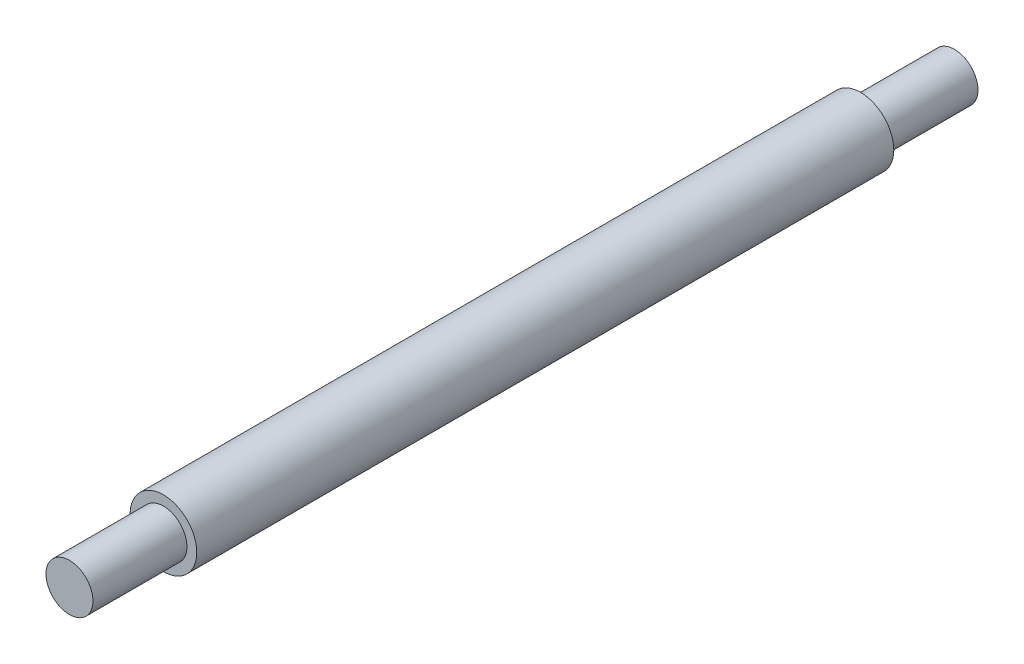
ISO-10303-21;
HEADER;
FILE_DESCRIPTION(('STEP AP214'),'2;1');
FILE_NAME('part.step','',(''),(''),'','','');
FILE_SCHEMA(('AUTOMOTIVE_DESIGN { 1 0 10303 214 1 1 1 1 }'));
ENDSEC;
DATA;
#1=APPLICATION_CONTEXT('core data for automotive mechanical design processes');
#2=APPLICATION_PROTOCOL_DEFINITION('international standard','automotive_design',2000,#1);
#3=PRODUCT_CONTEXT('',#1,'mechanical');
#4=PRODUCT('Part','Part','',(#3));
#5=PRODUCT_RELATED_PRODUCT_CATEGORY('part','',(#4));
#6=PRODUCT_DEFINITION_FORMATION('','',#4);
#7=PRODUCT_DEFINITION_CONTEXT('part definition',#1,'design');
#8=PRODUCT_DEFINITION('design','',#6,#7);
#9=PRODUCT_DEFINITION_SHAPE('','',#8);
#10=(LENGTH_UNIT() NAMED_UNIT(*) SI_UNIT(.MILLI.,.METRE.));
#11=(NAMED_UNIT(*) PLANE_ANGLE_UNIT() SI_UNIT($,.RADIAN.));
#12=(NAMED_UNIT(*) SI_UNIT($,.STERADIAN.) SOLID_ANGLE_UNIT());
#13=UNCERTAINTY_MEASURE_WITH_UNIT(LENGTH_MEASURE(1.E-05),#10,'distance_accuracy_value','');
#14=(GEOMETRIC_REPRESENTATION_CONTEXT(3) GLOBAL_UNCERTAINTY_ASSIGNED_CONTEXT((#13)) GLOBAL_UNIT_ASSIGNED_CONTEXT((#10,
#11,#12)) REPRESENTATION_CONTEXT('',''));
#15=CARTESIAN_POINT('',(0.,0.,0.));
#16=DIRECTION('',(0.,0.,1.));
#17=DIRECTION('',(1.,0.,0.));
#18=AXIS2_PLACEMENT_3D('',#15,#16,#17);
#19=CARTESIAN_POINT('',(0.,0.,0.));
#20=DIRECTION('',(0.,0.,1.));
#21=DIRECTION('',(1.,0.,0.));
#22=AXIS2_PLACEMENT_3D('',#19,#20,#21);
#23=PLANE('',#22);
#24=CARTESIAN_POINT('',(0.,0.,0.));
#25=DIRECTION('',(0.,0.,1.));
#26=DIRECTION('',(1.,0.,0.));
#27=AXIS2_PLACEMENT_3D('',#24,#25,#26);
#28=CIRCLE('',#27,3.);
#29=CARTESIAN_POINT('',(3.,0.,0.));
#30=VERTEX_POINT('',#29);
#31=EDGE_CURVE('E53',#30,#30,#28,.T.);
#32=ORIENTED_EDGE('',*,*,#31,.T.);
#33=EDGE_LOOP('',(#32));
#34=FACE_BOUND('',#33,.T.);
#35=ADVANCED_FACE('F31',(#34),#23,.T.);
#36=CARTESIAN_POINT('',(0.,0.,-113.));
#37=DIRECTION('',(0.,0.,-1.));
#38=DIRECTION('',(-1.,0.,0.));
#39=AXIS2_PLACEMENT_3D('',#36,#37,#38);
#40=PLANE('',#39);
#41=CARTESIAN_POINT('',(0.,0.,-113.));
#42=DIRECTION('',(0.,0.,1.));
#43=DIRECTION('',(1.,0.,0.));
#44=AXIS2_PLACEMENT_3D('',#41,#42,#43);
#45=CIRCLE('',#44,3.);
#46=CARTESIAN_POINT('',(3.,0.,-113.));
#47=VERTEX_POINT('',#46);
#48=EDGE_CURVE('E10',#47,#47,#45,.T.);
#49=ORIENTED_EDGE('',*,*,#48,.F.);
#50=EDGE_LOOP('',(#49));
#51=FACE_BOUND('',#50,.T.);
#52=ADVANCED_FACE('F70',(#51),#40,.T.);
#53=CARTESIAN_POINT('',(0.,0.,0.));
#54=DIRECTION('',(0.,0.,1.));
#55=DIRECTION('',(1.,0.,0.));
#56=AXIS2_PLACEMENT_3D('',#53,#54,#55);
#57=CYLINDRICAL_SURFACE('',#56,3.);
#58=ORIENTED_EDGE('',*,*,#48,.T.);
#59=EDGE_LOOP('',(#58));
#60=FACE_BOUND('',#59,.T.);
#61=CARTESIAN_POINT('',(0.,0.,-101.));
#62=DIRECTION('',(0.,0.,1.));
#63=DIRECTION('',(1.,0.,0.));
#64=AXIS2_PLACEMENT_3D('',#61,#62,#63);
#65=CIRCLE('',#64,3.);
#66=CARTESIAN_POINT('',(3.,0.,-101.));
#67=VERTEX_POINT('',#66);
#68=EDGE_CURVE('E37',#67,#67,#65,.T.);
#69=ORIENTED_EDGE('',*,*,#68,.F.);
#70=EDGE_LOOP('',(#69));
#71=FACE_BOUND('',#70,.T.);
#72=ADVANCED_FACE('F74',(#60,#71),#57,.T.);
#73=CARTESIAN_POINT('',(0.,0.,-101.));
#74=DIRECTION('',(0.,0.,-1.));
#75=DIRECTION('',(-1.,0.,0.));
#76=AXIS2_PLACEMENT_3D('',#73,#74,#75);
#77=PLANE('',#76);
#78=ORIENTED_EDGE('',*,*,#68,.T.);
#79=EDGE_LOOP('',(#78));
#80=FACE_BOUND('',#79,.T.);
#81=CARTESIAN_POINT('',(0.,0.,-101.));
#82=DIRECTION('',(0.,0.,1.));
#83=DIRECTION('',(1.,0.,0.));
#84=AXIS2_PLACEMENT_3D('',#81,#82,#83);
#85=CIRCLE('',#84,4.25);
#86=CARTESIAN_POINT('',(4.25,0.,-101.));
#87=VERTEX_POINT('',#86);
#88=EDGE_CURVE('E41',#87,#87,#85,.T.);
#89=ORIENTED_EDGE('',*,*,#88,.F.);
#90=EDGE_LOOP('',(#89));
#91=FACE_BOUND('',#90,.T.);
#92=ADVANCED_FACE('F79',(#80,#91),#77,.T.);
#93=CARTESIAN_POINT('',(0.,0.,0.));
#94=DIRECTION('',(0.,0.,1.));
#95=DIRECTION('',(1.,0.,0.));
#96=AXIS2_PLACEMENT_3D('',#93,#94,#95);
#97=CYLINDRICAL_SURFACE('',#96,4.25);
#98=ORIENTED_EDGE('',*,*,#88,.T.);
#99=EDGE_LOOP('',(#98));
#100=FACE_BOUND('',#99,.T.);
#101=CARTESIAN_POINT('',(0.,0.,-12.));
#102=DIRECTION('',(0.,0.,1.));
#103=DIRECTION('',(1.,0.,0.));
#104=AXIS2_PLACEMENT_3D('',#101,#102,#103);
#105=CIRCLE('',#104,4.25);
#106=CARTESIAN_POINT('',(4.25,0.,-12.));
#107=VERTEX_POINT('',#106);
#108=EDGE_CURVE('E45',#107,#107,#105,.T.);
#109=ORIENTED_EDGE('',*,*,#108,.F.);
#110=EDGE_LOOP('',(#109));
#111=FACE_BOUND('',#110,.T.);
#112=ADVANCED_FACE('F66',(#100,#111),#97,.T.);
#113=CARTESIAN_POINT('',(0.,0.,-12.));
#114=DIRECTION('',(0.,0.,1.));
#115=DIRECTION('',(1.,0.,0.));
#116=AXIS2_PLACEMENT_3D('',#113,#114,#115);
#117=PLANE('',#116);
#118=ORIENTED_EDGE('',*,*,#108,.T.);
#119=EDGE_LOOP('',(#118));
#120=FACE_BOUND('',#119,.T.);
#121=CARTESIAN_POINT('',(0.,0.,-12.));
#122=DIRECTION('',(0.,0.,1.));
#123=DIRECTION('',(1.,0.,0.));
#124=AXIS2_PLACEMENT_3D('',#121,#122,#123);
#125=CIRCLE('',#124,3.);
#126=CARTESIAN_POINT('',(3.,0.,-12.));
#127=VERTEX_POINT('',#126);
#128=EDGE_CURVE('E50',#127,#127,#125,.T.);
#129=ORIENTED_EDGE('',*,*,#128,.F.);
#130=EDGE_LOOP('',(#129));
#131=FACE_BOUND('',#130,.T.);
#132=ADVANCED_FACE('F60',(#120,#131),#117,.T.);
#133=CARTESIAN_POINT('',(0.,0.,0.));
#134=DIRECTION('',(0.,0.,1.));
#135=DIRECTION('',(1.,0.,0.));
#136=AXIS2_PLACEMENT_3D('',#133,#134,#135);
#137=CYLINDRICAL_SURFACE('',#136,3.);
#138=ORIENTED_EDGE('',*,*,#128,.T.);
#139=EDGE_LOOP('',(#138));
#140=FACE_BOUND('',#139,.T.);
#141=ORIENTED_EDGE('',*,*,#31,.F.);
#142=EDGE_LOOP('',(#141));
#143=FACE_BOUND('',#142,.T.);
#144=ADVANCED_FACE('F58',(#140,#143),#137,.T.);
#145=CLOSED_SHELL('',(#35,#52,#72,#92,#112,#132,#144));
#146=MANIFOLD_SOLID_BREP('B2',#145);
#147=ADVANCED_BREP_SHAPE_REPRESENTATION('',(#18,#146),#14);
#148=SHAPE_DEFINITION_REPRESENTATION(#9,#147);
ENDSEC;
END-ISO-10303-21;
